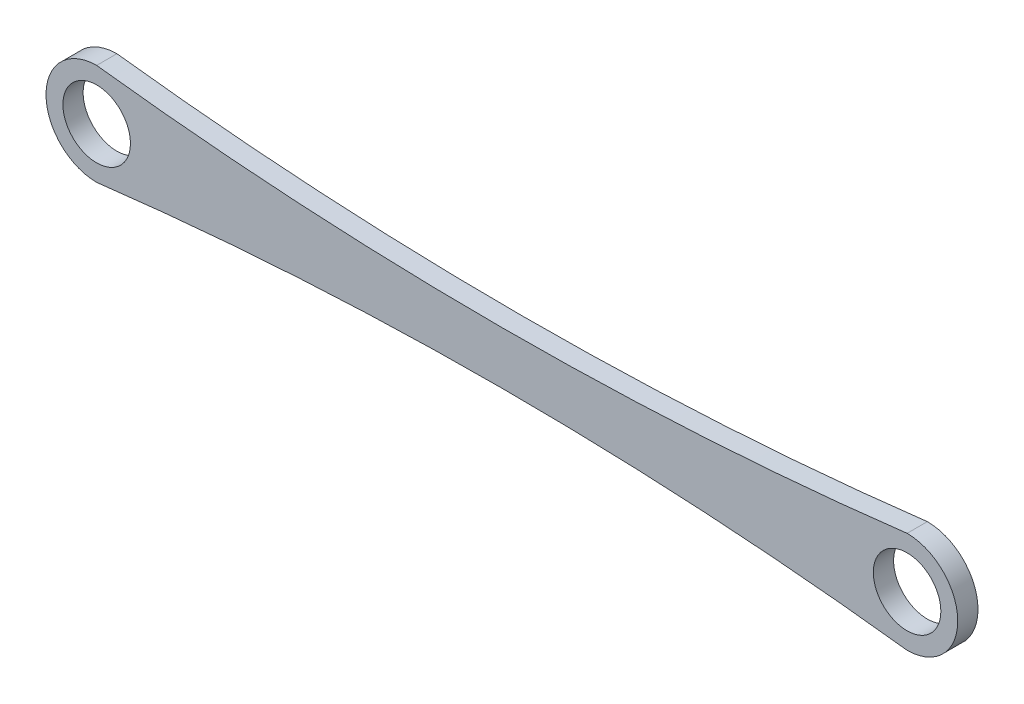
ISO-10303-21;
HEADER;
FILE_DESCRIPTION(('STEP AP214'),'2;1');
FILE_NAME('part.step','',(''),(''),'','','');
FILE_SCHEMA(('AUTOMOTIVE_DESIGN { 1 0 10303 214 1 1 1 1 }'));
ENDSEC;
DATA;
#1=APPLICATION_CONTEXT('core data for automotive mechanical design processes');
#2=APPLICATION_PROTOCOL_DEFINITION('international standard','automotive_design',2000,#1);
#3=PRODUCT_CONTEXT('',#1,'mechanical');
#4=PRODUCT('Part','Part','',(#3));
#5=PRODUCT_RELATED_PRODUCT_CATEGORY('part','',(#4));
#6=PRODUCT_DEFINITION_FORMATION('','',#4);
#7=PRODUCT_DEFINITION_CONTEXT('part definition',#1,'design');
#8=PRODUCT_DEFINITION('design','',#6,#7);
#9=PRODUCT_DEFINITION_SHAPE('','',#8);
#10=(LENGTH_UNIT() NAMED_UNIT(*) SI_UNIT(.MILLI.,.METRE.));
#11=(NAMED_UNIT(*) PLANE_ANGLE_UNIT() SI_UNIT($,.RADIAN.));
#12=(NAMED_UNIT(*) SI_UNIT($,.STERADIAN.) SOLID_ANGLE_UNIT());
#13=UNCERTAINTY_MEASURE_WITH_UNIT(LENGTH_MEASURE(1.E-05),#10,'distance_accuracy_value','');
#14=(GEOMETRIC_REPRESENTATION_CONTEXT(3) GLOBAL_UNCERTAINTY_ASSIGNED_CONTEXT((#13)) GLOBAL_UNIT_ASSIGNED_CONTEXT((#10,
#11,#12)) REPRESENTATION_CONTEXT('',''));
#15=CARTESIAN_POINT('',(0.,0.,0.));
#16=DIRECTION('',(0.,0.,1.));
#17=DIRECTION('',(1.,0.,0.));
#18=AXIS2_PLACEMENT_3D('',#15,#16,#17);
#19=CARTESIAN_POINT('',(0.,0.,3.));
#20=DIRECTION('',(0.,0.,-1.));
#21=DIRECTION('',(-1.,0.,0.));
#22=AXIS2_PLACEMENT_3D('',#19,#20,#21);
#23=CYLINDRICAL_SURFACE('',#22,7.5);
#24=CARTESIAN_POINT('',(0.,0.,0.));
#25=DIRECTION('',(0.,0.,1.));
#26=DIRECTION('',(1.,0.,0.));
#27=AXIS2_PLACEMENT_3D('',#24,#25,#26);
#28=CIRCLE('',#27,7.5);
#29=CARTESIAN_POINT('',(0.,7.5,0.));
#30=VERTEX_POINT('',#29);
#31=CARTESIAN_POINT('',(0.,-7.5,0.));
#32=VERTEX_POINT('',#31);
#33=EDGE_CURVE('E113',#30,#32,#28,.T.);
#34=ORIENTED_EDGE('',*,*,#33,.T.);
#35=DIRECTION('',(0.,0.,-1.));
#36=VECTOR('',#35,1.);
#37=CARTESIAN_POINT('',(0.,-7.5,3.));
#38=LINE('',#37,#36);
#39=CARTESIAN_POINT('',(0.,-7.5,3.));
#40=VERTEX_POINT('',#39);
#41=EDGE_CURVE('E11',#40,#32,#38,.T.);
#42=ORIENTED_EDGE('',*,*,#41,.F.);
#43=CARTESIAN_POINT('',(0.,0.,3.));
#44=DIRECTION('',(0.,0.,1.));
#45=DIRECTION('',(1.,0.,0.));
#46=AXIS2_PLACEMENT_3D('',#43,#44,#45);
#47=CIRCLE('',#46,7.5);
#48=CARTESIAN_POINT('',(0.,7.5,3.));
#49=VERTEX_POINT('',#48);
#50=EDGE_CURVE('E93',#49,#40,#47,.T.);
#51=ORIENTED_EDGE('',*,*,#50,.F.);
#52=DIRECTION('',(0.,0.,-1.));
#53=VECTOR('',#52,1.);
#54=CARTESIAN_POINT('',(0.,7.5,3.));
#55=LINE('',#54,#53);
#56=EDGE_CURVE('E60',#49,#30,#55,.T.);
#57=ORIENTED_EDGE('',*,*,#56,.T.);
#58=EDGE_LOOP('',(#34,#42,#51,#57));
#59=FACE_BOUND('',#58,.T.);
#60=ADVANCED_FACE('F43',(#59),#23,.T.);
#61=CARTESIAN_POINT('',(60.,-503.886945839634,3.));
#62=DIRECTION('',(0.,0.,-1.));
#63=DIRECTION('',(-1.,0.,0.));
#64=AXIS2_PLACEMENT_3D('',#61,#62,#63);
#65=CYLINDRICAL_SURFACE('',#64,500.);
#66=CARTESIAN_POINT('',(60.,-503.886945839634,0.));
#67=DIRECTION('',(0.,0.,1.));
#68=DIRECTION('',(1.,0.,0.));
#69=AXIS2_PLACEMENT_3D('',#66,#67,#68);
#70=CIRCLE('',#69,500.);
#71=CARTESIAN_POINT('',(120.,-7.5,0.));
#72=VERTEX_POINT('',#71);
#73=EDGE_CURVE('E98',#32,#72,#70,.F.);
#74=ORIENTED_EDGE('',*,*,#73,.T.);
#75=DIRECTION('',(0.,0.,-1.));
#76=VECTOR('',#75,1.);
#77=CARTESIAN_POINT('',(120.,-7.5,3.));
#78=LINE('',#77,#76);
#79=CARTESIAN_POINT('',(120.,-7.5,3.));
#80=VERTEX_POINT('',#79);
#81=EDGE_CURVE('E52',#80,#72,#78,.T.);
#82=ORIENTED_EDGE('',*,*,#81,.F.);
#83=CARTESIAN_POINT('',(60.,-503.886945839634,3.));
#84=DIRECTION('',(0.,0.,1.));
#85=DIRECTION('',(1.,0.,0.));
#86=AXIS2_PLACEMENT_3D('',#83,#84,#85);
#87=CIRCLE('',#86,500.);
#88=EDGE_CURVE('E86',#40,#80,#87,.F.);
#89=ORIENTED_EDGE('',*,*,#88,.F.);
#90=ORIENTED_EDGE('',*,*,#41,.T.);
#91=EDGE_LOOP('',(#74,#82,#89,#90));
#92=FACE_BOUND('',#91,.T.);
#93=ADVANCED_FACE('F97',(#92),#65,.F.);
#94=CARTESIAN_POINT('',(120.,0.,3.));
#95=DIRECTION('',(0.,0.,-1.));
#96=DIRECTION('',(-1.,0.,0.));
#97=AXIS2_PLACEMENT_3D('',#94,#95,#96);
#98=CYLINDRICAL_SURFACE('',#97,7.5);
#99=CARTESIAN_POINT('',(120.,0.,0.));
#100=DIRECTION('',(0.,0.,1.));
#101=DIRECTION('',(1.,0.,0.));
#102=AXIS2_PLACEMENT_3D('',#99,#100,#101);
#103=CIRCLE('',#102,7.5);
#104=CARTESIAN_POINT('',(120.,7.5,0.));
#105=VERTEX_POINT('',#104);
#106=EDGE_CURVE('E116',#72,#105,#103,.T.);
#107=ORIENTED_EDGE('',*,*,#106,.T.);
#108=DIRECTION('',(0.,0.,-1.));
#109=VECTOR('',#108,1.);
#110=CARTESIAN_POINT('',(120.,7.5,3.));
#111=LINE('',#110,#109);
#112=CARTESIAN_POINT('',(120.,7.5,3.));
#113=VERTEX_POINT('',#112);
#114=EDGE_CURVE('E75',#113,#105,#111,.T.);
#115=ORIENTED_EDGE('',*,*,#114,.F.);
#116=CARTESIAN_POINT('',(120.,0.,3.));
#117=DIRECTION('',(0.,0.,1.));
#118=DIRECTION('',(1.,0.,0.));
#119=AXIS2_PLACEMENT_3D('',#116,#117,#118);
#120=CIRCLE('',#119,7.5);
#121=EDGE_CURVE('E92',#80,#113,#120,.T.);
#122=ORIENTED_EDGE('',*,*,#121,.F.);
#123=ORIENTED_EDGE('',*,*,#81,.T.);
#124=EDGE_LOOP('',(#107,#115,#122,#123));
#125=FACE_BOUND('',#124,.T.);
#126=ADVANCED_FACE('F101',(#125),#98,.T.);
#127=CARTESIAN_POINT('',(120.,0.,3.));
#128=DIRECTION('',(0.,0.,-1.));
#129=DIRECTION('',(-1.,0.,0.));
#130=AXIS2_PLACEMENT_3D('',#127,#128,#129);
#131=CYLINDRICAL_SURFACE('',#130,5.);
#132=CARTESIAN_POINT('',(120.,0.,3.));
#133=DIRECTION('',(0.,0.,1.));
#134=DIRECTION('',(1.,0.,0.));
#135=AXIS2_PLACEMENT_3D('',#132,#133,#134);
#136=CIRCLE('',#135,5.);
#137=CARTESIAN_POINT('',(125.,0.,3.));
#138=VERTEX_POINT('',#137);
#139=EDGE_CURVE('E125',#138,#138,#136,.T.);
#140=ORIENTED_EDGE('',*,*,#139,.T.);
#141=EDGE_LOOP('',(#140));
#142=FACE_BOUND('',#141,.T.);
#143=CARTESIAN_POINT('',(120.,0.,0.));
#144=DIRECTION('',(0.,0.,1.));
#145=DIRECTION('',(1.,0.,0.));
#146=AXIS2_PLACEMENT_3D('',#143,#144,#145);
#147=CIRCLE('',#146,5.);
#148=CARTESIAN_POINT('',(125.,0.,0.));
#149=VERTEX_POINT('',#148);
#150=EDGE_CURVE('E110',#149,#149,#147,.T.);
#151=ORIENTED_EDGE('',*,*,#150,.F.);
#152=EDGE_LOOP('',(#151));
#153=FACE_BOUND('',#152,.T.);
#154=ADVANCED_FACE('F133',(#142,#153),#131,.F.);
#155=CARTESIAN_POINT('',(0.,0.,3.));
#156=DIRECTION('',(0.,0.,-1.));
#157=DIRECTION('',(-1.,0.,0.));
#158=AXIS2_PLACEMENT_3D('',#155,#156,#157);
#159=CYLINDRICAL_SURFACE('',#158,5.);
#160=CARTESIAN_POINT('',(0.,0.,3.));
#161=DIRECTION('',(0.,0.,1.));
#162=DIRECTION('',(1.,0.,0.));
#163=AXIS2_PLACEMENT_3D('',#160,#161,#162);
#164=CIRCLE('',#163,5.);
#165=CARTESIAN_POINT('',(5.,0.,3.));
#166=VERTEX_POINT('',#165);
#167=EDGE_CURVE('E121',#166,#166,#164,.T.);
#168=ORIENTED_EDGE('',*,*,#167,.T.);
#169=EDGE_LOOP('',(#168));
#170=FACE_BOUND('',#169,.T.);
#171=CARTESIAN_POINT('',(0.,0.,0.));
#172=DIRECTION('',(0.,0.,1.));
#173=DIRECTION('',(1.,0.,0.));
#174=AXIS2_PLACEMENT_3D('',#171,#172,#173);
#175=CIRCLE('',#174,5.);
#176=CARTESIAN_POINT('',(5.,0.,0.));
#177=VERTEX_POINT('',#176);
#178=EDGE_CURVE('E107',#177,#177,#175,.T.);
#179=ORIENTED_EDGE('',*,*,#178,.F.);
#180=EDGE_LOOP('',(#179));
#181=FACE_BOUND('',#180,.T.);
#182=ADVANCED_FACE('F45',(#170,#181),#159,.F.);
#183=CARTESIAN_POINT('',(60.,503.886945839634,3.));
#184=DIRECTION('',(0.,0.,-1.));
#185=DIRECTION('',(-1.,0.,0.));
#186=AXIS2_PLACEMENT_3D('',#183,#184,#185);
#187=CYLINDRICAL_SURFACE('',#186,500.);
#188=CARTESIAN_POINT('',(60.,503.886945839634,0.));
#189=DIRECTION('',(0.,0.,1.));
#190=DIRECTION('',(1.,0.,0.));
#191=AXIS2_PLACEMENT_3D('',#188,#189,#190);
#192=CIRCLE('',#191,500.);
#193=EDGE_CURVE('E118',#30,#105,#192,.T.);
#194=ORIENTED_EDGE('',*,*,#193,.F.);
#195=ORIENTED_EDGE('',*,*,#56,.F.);
#196=CARTESIAN_POINT('',(60.,503.886945839634,3.));
#197=DIRECTION('',(0.,0.,1.));
#198=DIRECTION('',(1.,0.,0.));
#199=AXIS2_PLACEMENT_3D('',#196,#197,#198);
#200=CIRCLE('',#199,500.);
#201=EDGE_CURVE('E102',#49,#113,#200,.T.);
#202=ORIENTED_EDGE('',*,*,#201,.T.);
#203=ORIENTED_EDGE('',*,*,#114,.T.);
#204=EDGE_LOOP('',(#194,#195,#202,#203));
#205=FACE_BOUND('',#204,.T.);
#206=ADVANCED_FACE('F138',(#205),#187,.F.);
#207=CARTESIAN_POINT('',(0.,0.,3.));
#208=DIRECTION('',(0.,0.,1.));
#209=DIRECTION('',(1.,0.,0.));
#210=AXIS2_PLACEMENT_3D('',#207,#208,#209);
#211=PLANE('',#210);
#212=ORIENTED_EDGE('',*,*,#167,.F.);
#213=EDGE_LOOP('',(#212));
#214=FACE_BOUND('',#213,.T.);
#215=ORIENTED_EDGE('',*,*,#139,.F.);
#216=EDGE_LOOP('',(#215));
#217=FACE_BOUND('',#216,.T.);
#218=ORIENTED_EDGE('',*,*,#50,.T.);
#219=ORIENTED_EDGE('',*,*,#88,.T.);
#220=ORIENTED_EDGE('',*,*,#121,.T.);
#221=ORIENTED_EDGE('',*,*,#201,.F.);
#222=EDGE_LOOP('',(#218,#219,#220,#221));
#223=FACE_BOUND('',#222,.T.);
#224=ADVANCED_FACE('F89',(#214,#217,#223),#211,.T.);
#225=CARTESIAN_POINT('',(0.,0.,0.));
#226=DIRECTION('',(0.,0.,1.));
#227=DIRECTION('',(1.,0.,0.));
#228=AXIS2_PLACEMENT_3D('',#225,#226,#227);
#229=PLANE('',#228);
#230=ORIENTED_EDGE('',*,*,#178,.T.);
#231=EDGE_LOOP('',(#230));
#232=FACE_BOUND('',#231,.T.);
#233=ORIENTED_EDGE('',*,*,#150,.T.);
#234=EDGE_LOOP('',(#233));
#235=FACE_BOUND('',#234,.T.);
#236=ORIENTED_EDGE('',*,*,#33,.F.);
#237=ORIENTED_EDGE('',*,*,#193,.T.);
#238=ORIENTED_EDGE('',*,*,#106,.F.);
#239=ORIENTED_EDGE('',*,*,#73,.F.);
#240=EDGE_LOOP('',(#236,#237,#238,#239));
#241=FACE_BOUND('',#240,.T.);
#242=ADVANCED_FACE('F137',(#232,#235,#241),#229,.F.);
#243=CLOSED_SHELL('',(#60,#93,#126,#154,#182,#206,#224,#242));
#244=MANIFOLD_SOLID_BREP('B2',#243);
#245=ADVANCED_BREP_SHAPE_REPRESENTATION('',(#18,#244),#14);
#246=SHAPE_DEFINITION_REPRESENTATION(#9,#245);
ENDSEC;
END-ISO-10303-21;
